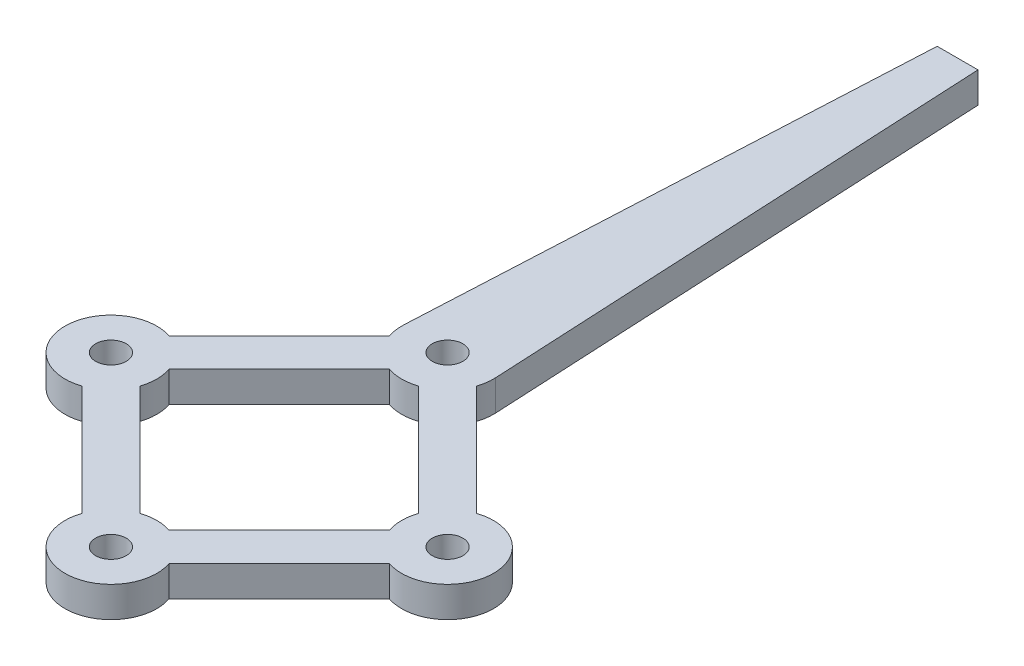
ISO-10303-21;
HEADER;
FILE_DESCRIPTION(('STEP AP214'),'2;1');
FILE_NAME('part.step','',(''),(''),'','','');
FILE_SCHEMA(('AUTOMOTIVE_DESIGN { 1 0 10303 214 1 1 1 1 }'));
ENDSEC;
DATA;
#1=APPLICATION_CONTEXT('core data for automotive mechanical design processes');
#2=APPLICATION_PROTOCOL_DEFINITION('international standard','automotive_design',2000,#1);
#3=PRODUCT_CONTEXT('',#1,'mechanical');
#4=PRODUCT('Part','Part','',(#3));
#5=PRODUCT_RELATED_PRODUCT_CATEGORY('part','',(#4));
#6=PRODUCT_DEFINITION_FORMATION('','',#4);
#7=PRODUCT_DEFINITION_CONTEXT('part definition',#1,'design');
#8=PRODUCT_DEFINITION('design','',#6,#7);
#9=PRODUCT_DEFINITION_SHAPE('','',#8);
#10=(LENGTH_UNIT() NAMED_UNIT(*) SI_UNIT(.MILLI.,.METRE.));
#11=(NAMED_UNIT(*) PLANE_ANGLE_UNIT() SI_UNIT($,.RADIAN.));
#12=(NAMED_UNIT(*) SI_UNIT($,.STERADIAN.) SOLID_ANGLE_UNIT());
#13=UNCERTAINTY_MEASURE_WITH_UNIT(LENGTH_MEASURE(1.E-05),#10,'distance_accuracy_value','');
#14=(GEOMETRIC_REPRESENTATION_CONTEXT(3) GLOBAL_UNCERTAINTY_ASSIGNED_CONTEXT((#13)) GLOBAL_UNIT_ASSIGNED_CONTEXT((#10,
#11,#12)) REPRESENTATION_CONTEXT('',''));
#15=CARTESIAN_POINT('',(0.,0.,0.));
#16=DIRECTION('',(0.,0.,1.));
#17=DIRECTION('',(1.,0.,0.));
#18=AXIS2_PLACEMENT_3D('',#15,#16,#17);
#19=CARTESIAN_POINT('',(0.,3.,-33.));
#20=DIRECTION('',(0.,1.,0.));
#21=DIRECTION('',(0.,0.,1.));
#22=AXIS2_PLACEMENT_3D('',#19,#20,#21);
#23=PLANE('',#22);
#24=CARTESIAN_POINT('',(16.5,3.,-16.5));
#25=DIRECTION('',(0.,1.,0.));
#26=DIRECTION('',(0.,0.,1.));
#27=AXIS2_PLACEMENT_3D('',#24,#25,#26);
#28=CIRCLE('',#27,1.5);
#29=CARTESIAN_POINT('',(16.5,3.,-15.));
#30=VERTEX_POINT('',#29);
#31=EDGE_CURVE('E236',#30,#30,#28,.T.);
#32=ORIENTED_EDGE('',*,*,#31,.F.);
#33=EDGE_LOOP('',(#32));
#34=FACE_BOUND('',#33,.T.);
#35=CARTESIAN_POINT('',(0.,3.,-33.));
#36=DIRECTION('',(0.,1.,0.));
#37=DIRECTION('',(0.,0.,1.));
#38=AXIS2_PLACEMENT_3D('',#35,#36,#37);
#39=CIRCLE('',#38,1.5);
#40=CARTESIAN_POINT('',(0.,3.,-31.5));
#41=VERTEX_POINT('',#40);
#42=EDGE_CURVE('E248',#41,#41,#39,.T.);
#43=ORIENTED_EDGE('',*,*,#42,.F.);
#44=EDGE_LOOP('',(#43));
#45=FACE_BOUND('',#44,.T.);
#46=CARTESIAN_POINT('',(0.,3.,-33.));
#47=DIRECTION('',(0.,1.,0.));
#48=DIRECTION('',(0.,0.,1.));
#49=AXIS2_PLACEMENT_3D('',#46,#47,#48);
#50=CIRCLE('',#49,4.5);
#51=CARTESIAN_POINT('',(-4.49639133210419,3.,-33.1801804333948));
#52=VERTEX_POINT('',#51);
#53=CARTESIAN_POINT('',(-4.26465212512094,3.,-31.5637749996253));
#54=VERTEX_POINT('',#53);
#55=EDGE_CURVE('E260',#52,#54,#50,.T.);
#56=ORIENTED_EDGE('',*,*,#55,.T.);
#57=DIRECTION('',(-0.707106781186548,0.,0.707106781186547));
#58=VECTOR('',#57,1.);
#59=CARTESIAN_POINT('',(-15.0637749996253,3.,-20.7646521251209));
#60=LINE('',#59,#58);
#61=CARTESIAN_POINT('',(-15.0637749996253,3.,-20.7646521251209));
#62=VERTEX_POINT('',#61);
#63=EDGE_CURVE('E263',#54,#62,#60,.T.);
#64=ORIENTED_EDGE('',*,*,#63,.T.);
#65=CARTESIAN_POINT('',(-16.5,3.,-16.5));
#66=DIRECTION('',(0.,1.,0.));
#67=DIRECTION('',(0.,0.,1.));
#68=AXIS2_PLACEMENT_3D('',#65,#66,#67);
#69=CIRCLE('',#68,4.5);
#70=CARTESIAN_POINT('',(-15.0637749996253,3.,-12.2353478748791));
#71=VERTEX_POINT('',#70);
#72=EDGE_CURVE('E266',#62,#71,#69,.T.);
#73=ORIENTED_EDGE('',*,*,#72,.T.);
#74=DIRECTION('',(0.707106781186548,0.,0.707106781186548));
#75=VECTOR('',#74,1.);
#76=CARTESIAN_POINT('',(-15.0637749996253,3.,-12.2353478748791));
#77=LINE('',#76,#75);
#78=CARTESIAN_POINT('',(-4.26465212512094,3.,-1.43622500037475));
#79=VERTEX_POINT('',#78);
#80=EDGE_CURVE('E268',#71,#79,#77,.T.);
#81=ORIENTED_EDGE('',*,*,#80,.T.);
#82=CARTESIAN_POINT('',(0.,3.,0.));
#83=DIRECTION('',(0.,1.,0.));
#84=DIRECTION('',(0.,0.,1.));
#85=AXIS2_PLACEMENT_3D('',#82,#83,#84);
#86=CIRCLE('',#85,4.5);
#87=CARTESIAN_POINT('',(4.26465212512094,3.,-1.43622500037475));
#88=VERTEX_POINT('',#87);
#89=EDGE_CURVE('E270',#79,#88,#86,.T.);
#90=ORIENTED_EDGE('',*,*,#89,.T.);
#91=DIRECTION('',(0.707106781186548,0.,-0.707106781186547));
#92=VECTOR('',#91,1.);
#93=CARTESIAN_POINT('',(4.26465212512094,3.,-1.43622500037475));
#94=LINE('',#93,#92);
#95=CARTESIAN_POINT('',(15.0637749996253,3.,-12.2353478748791));
#96=VERTEX_POINT('',#95);
#97=EDGE_CURVE('E272',#88,#96,#94,.T.);
#98=ORIENTED_EDGE('',*,*,#97,.T.);
#99=CARTESIAN_POINT('',(16.5,3.,-16.5));
#100=DIRECTION('',(0.,1.,0.));
#101=DIRECTION('',(0.,0.,1.));
#102=AXIS2_PLACEMENT_3D('',#99,#100,#101);
#103=CIRCLE('',#102,4.5);
#104=CARTESIAN_POINT('',(15.0637749996253,3.,-20.7646521251209));
#105=VERTEX_POINT('',#104);
#106=EDGE_CURVE('E274',#96,#105,#103,.T.);
#107=ORIENTED_EDGE('',*,*,#106,.T.);
#108=DIRECTION('',(-0.707106781186548,0.,-0.707106781186547));
#109=VECTOR('',#108,1.);
#110=CARTESIAN_POINT('',(15.0637749996253,3.,-20.7646521251209));
#111=LINE('',#110,#109);
#112=CARTESIAN_POINT('',(4.26465212512094,3.,-31.5637749996253));
#113=VERTEX_POINT('',#112);
#114=EDGE_CURVE('E276',#105,#113,#111,.T.);
#115=ORIENTED_EDGE('',*,*,#114,.T.);
#116=CARTESIAN_POINT('',(0.,3.,-33.));
#117=DIRECTION('',(0.,1.,0.));
#118=DIRECTION('',(0.,0.,1.));
#119=AXIS2_PLACEMENT_3D('',#116,#117,#118);
#120=CIRCLE('',#119,4.5);
#121=CARTESIAN_POINT('',(4.49436018053265,3.,-33.2252255927787));
#122=VERTEX_POINT('',#121);
#123=EDGE_CURVE('E278',#113,#122,#120,.T.);
#124=ORIENTED_EDGE('',*,*,#123,.T.);
#125=DIRECTION('',(-0.0500501317285987,0.,-0.998746706785034));
#126=VECTOR('',#125,1.);
#127=CARTESIAN_POINT('',(2.,3.,-83.));
#128=LINE('',#127,#126);
#129=CARTESIAN_POINT('',(2.,3.,-83.));
#130=VERTEX_POINT('',#129);
#131=EDGE_CURVE('E280',#122,#130,#128,.T.);
#132=ORIENTED_EDGE('',*,*,#131,.T.);
#133=DIRECTION('',(-1.,0.,0.));
#134=VECTOR('',#133,1.);
#135=CARTESIAN_POINT('',(-2.,3.,-83.));
#136=LINE('',#135,#134);
#137=CARTESIAN_POINT('',(-2.,3.,-83.));
#138=VERTEX_POINT('',#137);
#139=EDGE_CURVE('E282',#130,#138,#136,.T.);
#140=ORIENTED_EDGE('',*,*,#139,.T.);
#141=DIRECTION('',(-0.0500456085410825,0.,0.998746933444981));
#142=VECTOR('',#141,1.);
#143=CARTESIAN_POINT('',(-2.,3.,-83.));
#144=LINE('',#143,#142);
#145=EDGE_CURVE('E284',#138,#52,#144,.T.);
#146=ORIENTED_EDGE('',*,*,#145,.T.);
#147=EDGE_LOOP('',(#56,#64,#73,#81,#90,#98,#107,#115,#124,#132,#140,#146));
#148=FACE_BOUND('',#147,.T.);
#149=CARTESIAN_POINT('',(0.,3.,0.));
#150=DIRECTION('',(0.,1.,0.));
#151=DIRECTION('',(0.,0.,1.));
#152=AXIS2_PLACEMENT_3D('',#149,#150,#151);
#153=CIRCLE('',#152,1.5);
#154=CARTESIAN_POINT('',(0.,3.,1.5));
#155=VERTEX_POINT('',#154);
#156=EDGE_CURVE('E254',#155,#155,#153,.T.);
#157=ORIENTED_EDGE('',*,*,#156,.F.);
#158=EDGE_LOOP('',(#157));
#159=FACE_BOUND('',#158,.T.);
#160=CARTESIAN_POINT('',(-16.5,3.,-16.5));
#161=DIRECTION('',(0.,1.,0.));
#162=DIRECTION('',(0.,0.,-1.));
#163=AXIS2_PLACEMENT_3D('',#160,#161,#162);
#164=CIRCLE('',#163,1.5);
#165=CARTESIAN_POINT('',(-16.5,3.,-18.));
#166=VERTEX_POINT('',#165);
#167=EDGE_CURVE('E242',#166,#166,#164,.T.);
#168=ORIENTED_EDGE('',*,*,#167,.F.);
#169=EDGE_LOOP('',(#168));
#170=FACE_BOUND('',#169,.T.);
#171=DIRECTION('',(0.707106781186548,0.,-0.707106781186548));
#172=VECTOR('',#171,1.);
#173=CARTESIAN_POINT('',(1.43622500037475,3.,-4.26465212512094));
#174=LINE('',#173,#172);
#175=CARTESIAN_POINT('',(1.43622500037475,3.,-4.26465212512094));
#176=VERTEX_POINT('',#175);
#177=CARTESIAN_POINT('',(12.2353478748791,3.,-15.0637749996252));
#178=VERTEX_POINT('',#177);
#179=EDGE_CURVE('E179',#176,#178,#174,.T.);
#180=ORIENTED_EDGE('',*,*,#179,.F.);
#181=CARTESIAN_POINT('',(0.,3.,0.));
#182=DIRECTION('',(0.,-1.,0.));
#183=DIRECTION('',(0.,0.,1.));
#184=AXIS2_PLACEMENT_3D('',#181,#182,#183);
#185=CIRCLE('',#184,4.5);
#186=CARTESIAN_POINT('',(-1.43622500037475,3.,-4.26465212512094));
#187=VERTEX_POINT('',#186);
#188=EDGE_CURVE('E171',#187,#176,#185,.T.);
#189=ORIENTED_EDGE('',*,*,#188,.F.);
#190=DIRECTION('',(0.707106781186547,0.,0.707106781186548));
#191=VECTOR('',#190,1.);
#192=CARTESIAN_POINT('',(-12.2353478748791,3.,-15.0637749996253));
#193=LINE('',#192,#191);
#194=CARTESIAN_POINT('',(-12.2353478748791,3.,-15.0637749996252));
#195=VERTEX_POINT('',#194);
#196=EDGE_CURVE('E204',#195,#187,#193,.T.);
#197=ORIENTED_EDGE('',*,*,#196,.F.);
#198=CARTESIAN_POINT('',(-16.5,3.,-16.5));
#199=DIRECTION('',(0.,-1.,0.));
#200=DIRECTION('',(0.,0.,1.));
#201=AXIS2_PLACEMENT_3D('',#198,#199,#200);
#202=CIRCLE('',#201,4.5);
#203=CARTESIAN_POINT('',(-12.2353478748791,3.,-17.9362250003748));
#204=VERTEX_POINT('',#203);
#205=EDGE_CURVE('E202',#204,#195,#202,.T.);
#206=ORIENTED_EDGE('',*,*,#205,.F.);
#207=DIRECTION('',(-0.707106781186548,0.,0.707106781186547));
#208=VECTOR('',#207,1.);
#209=CARTESIAN_POINT('',(-12.2353478748791,3.,-17.9362250003748));
#210=LINE('',#209,#208);
#211=CARTESIAN_POINT('',(-1.43622500037475,3.,-28.7353478748791));
#212=VERTEX_POINT('',#211);
#213=EDGE_CURVE('E200',#212,#204,#210,.T.);
#214=ORIENTED_EDGE('',*,*,#213,.F.);
#215=CARTESIAN_POINT('',(0.,3.,-33.));
#216=DIRECTION('',(0.,-1.,0.));
#217=DIRECTION('',(0.,0.,1.));
#218=AXIS2_PLACEMENT_3D('',#215,#216,#217);
#219=CIRCLE('',#218,4.5);
#220=CARTESIAN_POINT('',(1.43622500037475,3.,-28.7353478748791));
#221=VERTEX_POINT('',#220);
#222=EDGE_CURVE('E198',#221,#212,#219,.T.);
#223=ORIENTED_EDGE('',*,*,#222,.F.);
#224=DIRECTION('',(-0.707106781186548,0.,-0.707106781186547));
#225=VECTOR('',#224,1.);
#226=CARTESIAN_POINT('',(12.2353478748791,3.,-17.9362250003748));
#227=LINE('',#226,#225);
#228=CARTESIAN_POINT('',(12.2353478748791,3.,-17.9362250003748));
#229=VERTEX_POINT('',#228);
#230=EDGE_CURVE('E194',#229,#221,#227,.T.);
#231=ORIENTED_EDGE('',*,*,#230,.F.);
#232=CARTESIAN_POINT('',(16.5,3.,-16.5));
#233=DIRECTION('',(0.,-1.,0.));
#234=DIRECTION('',(0.,0.,1.));
#235=AXIS2_PLACEMENT_3D('',#232,#233,#234);
#236=CIRCLE('',#235,4.5);
#237=EDGE_CURVE('E192',#178,#229,#236,.T.);
#238=ORIENTED_EDGE('',*,*,#237,.F.);
#239=EDGE_LOOP('',(#180,#189,#197,#206,#214,#223,#231,#238));
#240=FACE_BOUND('',#239,.T.);
#241=ADVANCED_FACE('F34',(#34,#45,#148,#159,#170,#240),#23,.T.);
#242=CARTESIAN_POINT('',(0.,0.,-33.));
#243=DIRECTION('',(0.,1.,0.));
#244=DIRECTION('',(0.,0.,1.));
#245=AXIS2_PLACEMENT_3D('',#242,#243,#244);
#246=PLANE('',#245);
#247=CARTESIAN_POINT('',(16.5,0.,-16.5));
#248=DIRECTION('',(0.,1.,0.));
#249=DIRECTION('',(0.,0.,1.));
#250=AXIS2_PLACEMENT_3D('',#247,#248,#249);
#251=CIRCLE('',#250,1.5);
#252=CARTESIAN_POINT('',(16.5,0.,-15.));
#253=VERTEX_POINT('',#252);
#254=EDGE_CURVE('E187',#253,#253,#251,.T.);
#255=ORIENTED_EDGE('',*,*,#254,.T.);
#256=EDGE_LOOP('',(#255));
#257=FACE_BOUND('',#256,.T.);
#258=CARTESIAN_POINT('',(0.,0.,-33.));
#259=DIRECTION('',(0.,1.,0.));
#260=DIRECTION('',(0.,0.,1.));
#261=AXIS2_PLACEMENT_3D('',#258,#259,#260);
#262=CIRCLE('',#261,1.5);
#263=CARTESIAN_POINT('',(0.,0.,-31.5));
#264=VERTEX_POINT('',#263);
#265=EDGE_CURVE('E245',#264,#264,#262,.T.);
#266=ORIENTED_EDGE('',*,*,#265,.T.);
#267=EDGE_LOOP('',(#266));
#268=FACE_BOUND('',#267,.T.);
#269=CARTESIAN_POINT('',(0.,0.,-33.));
#270=DIRECTION('',(0.,1.,0.));
#271=DIRECTION('',(0.,0.,1.));
#272=AXIS2_PLACEMENT_3D('',#269,#270,#271);
#273=CIRCLE('',#272,4.5);
#274=CARTESIAN_POINT('',(-4.49639133210419,0.,-33.1801804333948));
#275=VERTEX_POINT('',#274);
#276=CARTESIAN_POINT('',(-4.26465212512094,0.,-31.5637749996253));
#277=VERTEX_POINT('',#276);
#278=EDGE_CURVE('E257',#275,#277,#273,.T.);
#279=ORIENTED_EDGE('',*,*,#278,.F.);
#280=DIRECTION('',(-0.0500456085410825,0.,0.998746933444981));
#281=VECTOR('',#280,1.);
#282=CARTESIAN_POINT('',(-2.,0.,-83.));
#283=LINE('',#282,#281);
#284=CARTESIAN_POINT('',(-2.,0.,-83.));
#285=VERTEX_POINT('',#284);
#286=EDGE_CURVE('E264',#285,#275,#283,.T.);
#287=ORIENTED_EDGE('',*,*,#286,.F.);
#288=DIRECTION('',(-1.,0.,0.));
#289=VECTOR('',#288,1.);
#290=CARTESIAN_POINT('',(-2.,0.,-83.));
#291=LINE('',#290,#289);
#292=CARTESIAN_POINT('',(2.,0.,-83.));
#293=VERTEX_POINT('',#292);
#294=EDGE_CURVE('E307',#293,#285,#291,.T.);
#295=ORIENTED_EDGE('',*,*,#294,.F.);
#296=DIRECTION('',(-0.0500501317285987,0.,-0.998746706785034));
#297=VECTOR('',#296,1.);
#298=CARTESIAN_POINT('',(2.,0.,-83.));
#299=LINE('',#298,#297);
#300=CARTESIAN_POINT('',(4.49436018053265,0.,-33.2252255927787));
#301=VERTEX_POINT('',#300);
#302=EDGE_CURVE('E305',#301,#293,#299,.T.);
#303=ORIENTED_EDGE('',*,*,#302,.F.);
#304=CARTESIAN_POINT('',(0.,0.,-33.));
#305=DIRECTION('',(0.,1.,0.));
#306=DIRECTION('',(0.,0.,1.));
#307=AXIS2_PLACEMENT_3D('',#304,#305,#306);
#308=CIRCLE('',#307,4.5);
#309=CARTESIAN_POINT('',(4.26465212512094,0.,-31.5637749996253));
#310=VERTEX_POINT('',#309);
#311=EDGE_CURVE('E303',#310,#301,#308,.T.);
#312=ORIENTED_EDGE('',*,*,#311,.F.);
#313=DIRECTION('',(-0.707106781186548,0.,-0.707106781186547));
#314=VECTOR('',#313,1.);
#315=CARTESIAN_POINT('',(15.0637749996253,0.,-20.7646521251209));
#316=LINE('',#315,#314);
#317=CARTESIAN_POINT('',(15.0637749996253,0.,-20.7646521251209));
#318=VERTEX_POINT('',#317);
#319=EDGE_CURVE('E301',#318,#310,#316,.T.);
#320=ORIENTED_EDGE('',*,*,#319,.F.);
#321=CARTESIAN_POINT('',(16.5,0.,-16.5));
#322=DIRECTION('',(0.,1.,0.));
#323=DIRECTION('',(0.,0.,1.));
#324=AXIS2_PLACEMENT_3D('',#321,#322,#323);
#325=CIRCLE('',#324,4.5);
#326=CARTESIAN_POINT('',(15.0637749996253,0.,-12.2353478748791));
#327=VERTEX_POINT('',#326);
#328=EDGE_CURVE('E299',#327,#318,#325,.T.);
#329=ORIENTED_EDGE('',*,*,#328,.F.);
#330=DIRECTION('',(0.707106781186548,0.,-0.707106781186547));
#331=VECTOR('',#330,1.);
#332=CARTESIAN_POINT('',(4.26465212512094,0.,-1.43622500037475));
#333=LINE('',#332,#331);
#334=CARTESIAN_POINT('',(4.26465212512094,0.,-1.43622500037475));
#335=VERTEX_POINT('',#334);
#336=EDGE_CURVE('E297',#335,#327,#333,.T.);
#337=ORIENTED_EDGE('',*,*,#336,.F.);
#338=CARTESIAN_POINT('',(0.,0.,0.));
#339=DIRECTION('',(0.,1.,0.));
#340=DIRECTION('',(0.,0.,1.));
#341=AXIS2_PLACEMENT_3D('',#338,#339,#340);
#342=CIRCLE('',#341,4.5);
#343=CARTESIAN_POINT('',(-4.26465212512094,0.,-1.43622500037475));
#344=VERTEX_POINT('',#343);
#345=EDGE_CURVE('E295',#344,#335,#342,.T.);
#346=ORIENTED_EDGE('',*,*,#345,.F.);
#347=DIRECTION('',(0.707106781186548,0.,0.707106781186548));
#348=VECTOR('',#347,1.);
#349=CARTESIAN_POINT('',(-15.0637749996253,0.,-12.2353478748791));
#350=LINE('',#349,#348);
#351=CARTESIAN_POINT('',(-15.0637749996253,0.,-12.2353478748791));
#352=VERTEX_POINT('',#351);
#353=EDGE_CURVE('E293',#352,#344,#350,.T.);
#354=ORIENTED_EDGE('',*,*,#353,.F.);
#355=CARTESIAN_POINT('',(-16.5,0.,-16.5));
#356=DIRECTION('',(0.,1.,0.));
#357=DIRECTION('',(0.,0.,1.));
#358=AXIS2_PLACEMENT_3D('',#355,#356,#357);
#359=CIRCLE('',#358,4.5);
#360=CARTESIAN_POINT('',(-15.0637749996253,0.,-20.7646521251209));
#361=VERTEX_POINT('',#360);
#362=EDGE_CURVE('E291',#361,#352,#359,.T.);
#363=ORIENTED_EDGE('',*,*,#362,.F.);
#364=DIRECTION('',(-0.707106781186548,0.,0.707106781186547));
#365=VECTOR('',#364,1.);
#366=CARTESIAN_POINT('',(-15.0637749996253,0.,-20.7646521251209));
#367=LINE('',#366,#365);
#368=EDGE_CURVE('E289',#277,#361,#367,.T.);
#369=ORIENTED_EDGE('',*,*,#368,.F.);
#370=EDGE_LOOP('',(#279,#287,#295,#303,#312,#320,#329,#337,#346,#354,#363,#369));
#371=FACE_BOUND('',#370,.T.);
#372=CARTESIAN_POINT('',(0.,0.,0.));
#373=DIRECTION('',(0.,1.,0.));
#374=DIRECTION('',(0.,0.,1.));
#375=AXIS2_PLACEMENT_3D('',#372,#373,#374);
#376=CIRCLE('',#375,1.5);
#377=CARTESIAN_POINT('',(0.,0.,1.5));
#378=VERTEX_POINT('',#377);
#379=EDGE_CURVE('E251',#378,#378,#376,.T.);
#380=ORIENTED_EDGE('',*,*,#379,.T.);
#381=EDGE_LOOP('',(#380));
#382=FACE_BOUND('',#381,.T.);
#383=CARTESIAN_POINT('',(-16.5,0.,-16.5));
#384=DIRECTION('',(0.,1.,0.));
#385=DIRECTION('',(0.,0.,-1.));
#386=AXIS2_PLACEMENT_3D('',#383,#384,#385);
#387=CIRCLE('',#386,1.5);
#388=CARTESIAN_POINT('',(-16.5,0.,-18.));
#389=VERTEX_POINT('',#388);
#390=EDGE_CURVE('E239',#389,#389,#387,.T.);
#391=ORIENTED_EDGE('',*,*,#390,.T.);
#392=EDGE_LOOP('',(#391));
#393=FACE_BOUND('',#392,.T.);
#394=CARTESIAN_POINT('',(0.,0.,0.));
#395=DIRECTION('',(0.,-1.,0.));
#396=DIRECTION('',(0.,0.,1.));
#397=AXIS2_PLACEMENT_3D('',#394,#395,#396);
#398=CIRCLE('',#397,4.5);
#399=CARTESIAN_POINT('',(-1.43622500037475,0.,-4.26465212512094));
#400=VERTEX_POINT('',#399);
#401=CARTESIAN_POINT('',(1.43622500037475,0.,-4.26465212512094));
#402=VERTEX_POINT('',#401);
#403=EDGE_CURVE('E57',#400,#402,#398,.T.);
#404=ORIENTED_EDGE('',*,*,#403,.T.);
#405=DIRECTION('',(0.707106781186548,0.,-0.707106781186548));
#406=VECTOR('',#405,1.);
#407=CARTESIAN_POINT('',(1.43622500037475,0.,-4.26465212512094));
#408=LINE('',#407,#406);
#409=CARTESIAN_POINT('',(12.2353478748791,0.,-15.0637749996252));
#410=VERTEX_POINT('',#409);
#411=EDGE_CURVE('E186',#402,#410,#408,.T.);
#412=ORIENTED_EDGE('',*,*,#411,.T.);
#413=CARTESIAN_POINT('',(16.5,0.,-16.5));
#414=DIRECTION('',(0.,-1.,0.));
#415=DIRECTION('',(0.,0.,1.));
#416=AXIS2_PLACEMENT_3D('',#413,#414,#415);
#417=CIRCLE('',#416,4.5);
#418=CARTESIAN_POINT('',(12.2353478748791,0.,-17.9362250003748));
#419=VERTEX_POINT('',#418);
#420=EDGE_CURVE('E208',#410,#419,#417,.T.);
#421=ORIENTED_EDGE('',*,*,#420,.T.);
#422=DIRECTION('',(-0.707106781186548,0.,-0.707106781186547));
#423=VECTOR('',#422,1.);
#424=CARTESIAN_POINT('',(12.2353478748791,0.,-17.9362250003748));
#425=LINE('',#424,#423);
#426=CARTESIAN_POINT('',(1.43622500037475,0.,-28.7353478748791));
#427=VERTEX_POINT('',#426);
#428=EDGE_CURVE('E211',#419,#427,#425,.T.);
#429=ORIENTED_EDGE('',*,*,#428,.T.);
#430=CARTESIAN_POINT('',(0.,0.,-33.));
#431=DIRECTION('',(0.,-1.,0.));
#432=DIRECTION('',(0.,0.,1.));
#433=AXIS2_PLACEMENT_3D('',#430,#431,#432);
#434=CIRCLE('',#433,4.5);
#435=CARTESIAN_POINT('',(-1.43622500037475,0.,-28.7353478748791));
#436=VERTEX_POINT('',#435);
#437=EDGE_CURVE('E214',#427,#436,#434,.T.);
#438=ORIENTED_EDGE('',*,*,#437,.T.);
#439=DIRECTION('',(-0.707106781186548,0.,0.707106781186547));
#440=VECTOR('',#439,1.);
#441=CARTESIAN_POINT('',(-12.2353478748791,0.,-17.9362250003748));
#442=LINE('',#441,#440);
#443=CARTESIAN_POINT('',(-12.2353478748791,0.,-17.9362250003748));
#444=VERTEX_POINT('',#443);
#445=EDGE_CURVE('E217',#436,#444,#442,.T.);
#446=ORIENTED_EDGE('',*,*,#445,.T.);
#447=CARTESIAN_POINT('',(-16.5,0.,-16.5));
#448=DIRECTION('',(0.,-1.,0.));
#449=DIRECTION('',(0.,0.,1.));
#450=AXIS2_PLACEMENT_3D('',#447,#448,#449);
#451=CIRCLE('',#450,4.5);
#452=CARTESIAN_POINT('',(-12.2353478748791,0.,-15.0637749996253));
#453=VERTEX_POINT('',#452);
#454=EDGE_CURVE('E220',#444,#453,#451,.T.);
#455=ORIENTED_EDGE('',*,*,#454,.T.);
#456=DIRECTION('',(0.707106781186547,0.,0.707106781186548));
#457=VECTOR('',#456,1.);
#458=CARTESIAN_POINT('',(-12.2353478748791,0.,-15.0637749996253));
#459=LINE('',#458,#457);
#460=EDGE_CURVE('E180',#453,#400,#459,.T.);
#461=ORIENTED_EDGE('',*,*,#460,.T.);
#462=EDGE_LOOP('',(#404,#412,#421,#429,#438,#446,#455,#461));
#463=FACE_BOUND('',#462,.T.);
#464=ADVANCED_FACE('F349',(#257,#268,#371,#382,#393,#463),#246,.F.);
#465=CARTESIAN_POINT('',(0.,3.,-33.));
#466=DIRECTION('',(0.,-1.,0.));
#467=DIRECTION('',(0.,0.,-1.));
#468=AXIS2_PLACEMENT_3D('',#465,#466,#467);
#469=CYLINDRICAL_SURFACE('',#468,4.5);
#470=ORIENTED_EDGE('',*,*,#278,.T.);
#471=DIRECTION('',(0.,-1.,0.));
#472=VECTOR('',#471,1.);
#473=CARTESIAN_POINT('',(-4.26465212512094,3.,-31.5637749996253));
#474=LINE('',#473,#472);
#475=EDGE_CURVE('E11',#54,#277,#474,.T.);
#476=ORIENTED_EDGE('',*,*,#475,.F.);
#477=ORIENTED_EDGE('',*,*,#55,.F.);
#478=DIRECTION('',(0.,-1.,0.));
#479=VECTOR('',#478,1.);
#480=CARTESIAN_POINT('',(-4.49639133210419,3.,-33.1801804333948));
#481=LINE('',#480,#479);
#482=EDGE_CURVE('E286',#52,#275,#481,.T.);
#483=ORIENTED_EDGE('',*,*,#482,.T.);
#484=EDGE_LOOP('',(#470,#476,#477,#483));
#485=FACE_BOUND('',#484,.T.);
#486=ADVANCED_FACE('F36',(#485),#469,.T.);
#487=CARTESIAN_POINT('',(-15.0637749996253,3.,-20.7646521251209));
#488=DIRECTION('',(0.707106781186547,0.,0.707106781186548));
#489=DIRECTION('',(0.707106781186548,0.,-0.707106781186547));
#490=AXIS2_PLACEMENT_3D('',#487,#488,#489);
#491=PLANE('',#490);
#492=ORIENTED_EDGE('',*,*,#368,.T.);
#493=DIRECTION('',(0.,-1.,0.));
#494=VECTOR('',#493,1.);
#495=CARTESIAN_POINT('',(-15.0637749996253,3.,-20.7646521251209));
#496=LINE('',#495,#494);
#497=EDGE_CURVE('E42',#62,#361,#496,.T.);
#498=ORIENTED_EDGE('',*,*,#497,.F.);
#499=ORIENTED_EDGE('',*,*,#63,.F.);
#500=ORIENTED_EDGE('',*,*,#475,.T.);
#501=EDGE_LOOP('',(#492,#498,#499,#500));
#502=FACE_BOUND('',#501,.T.);
#503=ADVANCED_FACE('F367',(#502),#491,.F.);
#504=CARTESIAN_POINT('',(-16.5,3.,-16.5));
#505=DIRECTION('',(0.,-1.,0.));
#506=DIRECTION('',(0.,0.,-1.));
#507=AXIS2_PLACEMENT_3D('',#504,#505,#506);
#508=CYLINDRICAL_SURFACE('',#507,4.5);
#509=ORIENTED_EDGE('',*,*,#362,.T.);
#510=DIRECTION('',(0.,-1.,0.));
#511=VECTOR('',#510,1.);
#512=CARTESIAN_POINT('',(-15.0637749996253,3.,-12.2353478748791));
#513=LINE('',#512,#511);
#514=EDGE_CURVE('E336',#71,#352,#513,.T.);
#515=ORIENTED_EDGE('',*,*,#514,.F.);
#516=ORIENTED_EDGE('',*,*,#72,.F.);
#517=ORIENTED_EDGE('',*,*,#497,.T.);
#518=EDGE_LOOP('',(#509,#515,#516,#517));
#519=FACE_BOUND('',#518,.T.);
#520=ADVANCED_FACE('F343',(#519),#508,.T.);
#521=CARTESIAN_POINT('',(-15.0637749996253,3.,-12.2353478748791));
#522=DIRECTION('',(0.707106781186547,0.,-0.707106781186547));
#523=DIRECTION('',(-0.707106781186548,0.,-0.707106781186548));
#524=AXIS2_PLACEMENT_3D('',#521,#522,#523);
#525=PLANE('',#524);
#526=ORIENTED_EDGE('',*,*,#353,.T.);
#527=DIRECTION('',(0.,-1.,0.));
#528=VECTOR('',#527,1.);
#529=CARTESIAN_POINT('',(-4.26465212512094,3.,-1.43622500037475));
#530=LINE('',#529,#528);
#531=EDGE_CURVE('E333',#79,#344,#530,.T.);
#532=ORIENTED_EDGE('',*,*,#531,.F.);
#533=ORIENTED_EDGE('',*,*,#80,.F.);
#534=ORIENTED_EDGE('',*,*,#514,.T.);
#535=EDGE_LOOP('',(#526,#532,#533,#534));
#536=FACE_BOUND('',#535,.T.);
#537=ADVANCED_FACE('F355',(#536),#525,.F.);
#538=CARTESIAN_POINT('',(0.,3.,0.));
#539=DIRECTION('',(0.,-1.,0.));
#540=DIRECTION('',(0.,0.,-1.));
#541=AXIS2_PLACEMENT_3D('',#538,#539,#540);
#542=CYLINDRICAL_SURFACE('',#541,4.5);
#543=ORIENTED_EDGE('',*,*,#345,.T.);
#544=DIRECTION('',(0.,-1.,0.));
#545=VECTOR('',#544,1.);
#546=CARTESIAN_POINT('',(4.26465212512094,3.,-1.43622500037475));
#547=LINE('',#546,#545);
#548=EDGE_CURVE('E330',#88,#335,#547,.T.);
#549=ORIENTED_EDGE('',*,*,#548,.F.);
#550=ORIENTED_EDGE('',*,*,#89,.F.);
#551=ORIENTED_EDGE('',*,*,#531,.T.);
#552=EDGE_LOOP('',(#543,#549,#550,#551));
#553=FACE_BOUND('',#552,.T.);
#554=ADVANCED_FACE('F359',(#553),#542,.T.);
#555=CARTESIAN_POINT('',(4.26465212512094,3.,-1.43622500037475));
#556=DIRECTION('',(-0.707106781186547,0.,-0.707106781186548));
#557=DIRECTION('',(-0.707106781186548,0.,0.707106781186547));
#558=AXIS2_PLACEMENT_3D('',#555,#556,#557);
#559=PLANE('',#558);
#560=ORIENTED_EDGE('',*,*,#336,.T.);
#561=DIRECTION('',(0.,-1.,0.));
#562=VECTOR('',#561,1.);
#563=CARTESIAN_POINT('',(15.0637749996253,3.,-12.2353478748791));
#564=LINE('',#563,#562);
#565=EDGE_CURVE('E327',#96,#327,#564,.T.);
#566=ORIENTED_EDGE('',*,*,#565,.F.);
#567=ORIENTED_EDGE('',*,*,#97,.F.);
#568=ORIENTED_EDGE('',*,*,#548,.T.);
#569=EDGE_LOOP('',(#560,#566,#567,#568));
#570=FACE_BOUND('',#569,.T.);
#571=ADVANCED_FACE('F400',(#570),#559,.F.);
#572=CARTESIAN_POINT('',(16.5,3.,-16.5));
#573=DIRECTION('',(0.,-1.,0.));
#574=DIRECTION('',(0.,0.,-1.));
#575=AXIS2_PLACEMENT_3D('',#572,#573,#574);
#576=CYLINDRICAL_SURFACE('',#575,4.5);
#577=ORIENTED_EDGE('',*,*,#328,.T.);
#578=DIRECTION('',(0.,-1.,0.));
#579=VECTOR('',#578,1.);
#580=CARTESIAN_POINT('',(15.0637749996253,3.,-20.7646521251209));
#581=LINE('',#580,#579);
#582=EDGE_CURVE('E324',#105,#318,#581,.T.);
#583=ORIENTED_EDGE('',*,*,#582,.F.);
#584=ORIENTED_EDGE('',*,*,#106,.F.);
#585=ORIENTED_EDGE('',*,*,#565,.T.);
#586=EDGE_LOOP('',(#577,#583,#584,#585));
#587=FACE_BOUND('',#586,.T.);
#588=ADVANCED_FACE('F398',(#587),#576,.T.);
#589=CARTESIAN_POINT('',(15.0637749996253,3.,-20.7646521251209));
#590=DIRECTION('',(-0.707106781186547,0.,0.707106781186548));
#591=DIRECTION('',(0.707106781186548,0.,0.707106781186547));
#592=AXIS2_PLACEMENT_3D('',#589,#590,#591);
#593=PLANE('',#592);
#594=ORIENTED_EDGE('',*,*,#319,.T.);
#595=DIRECTION('',(0.,-1.,0.));
#596=VECTOR('',#595,1.);
#597=CARTESIAN_POINT('',(4.26465212512094,3.,-31.5637749996253));
#598=LINE('',#597,#596);
#599=EDGE_CURVE('E321',#113,#310,#598,.T.);
#600=ORIENTED_EDGE('',*,*,#599,.F.);
#601=ORIENTED_EDGE('',*,*,#114,.F.);
#602=ORIENTED_EDGE('',*,*,#582,.T.);
#603=EDGE_LOOP('',(#594,#600,#601,#602));
#604=FACE_BOUND('',#603,.T.);
#605=ADVANCED_FACE('F394',(#604),#593,.F.);
#606=CARTESIAN_POINT('',(0.,3.,-33.));
#607=DIRECTION('',(0.,-1.,0.));
#608=DIRECTION('',(0.,0.,-1.));
#609=AXIS2_PLACEMENT_3D('',#606,#607,#608);
#610=CYLINDRICAL_SURFACE('',#609,4.5);
#611=ORIENTED_EDGE('',*,*,#311,.T.);
#612=DIRECTION('',(0.,-1.,0.));
#613=VECTOR('',#612,1.);
#614=CARTESIAN_POINT('',(4.49436018053265,3.,-33.2252255927787));
#615=LINE('',#614,#613);
#616=EDGE_CURVE('E318',#122,#301,#615,.T.);
#617=ORIENTED_EDGE('',*,*,#616,.F.);
#618=ORIENTED_EDGE('',*,*,#123,.F.);
#619=ORIENTED_EDGE('',*,*,#599,.T.);
#620=EDGE_LOOP('',(#611,#617,#618,#619));
#621=FACE_BOUND('',#620,.T.);
#622=ADVANCED_FACE('F389',(#621),#610,.T.);
#623=CARTESIAN_POINT('',(2.,3.,-83.));
#624=DIRECTION('',(-0.998746706785034,0.,0.0500501317285987));
#625=DIRECTION('',(0.0500501317285987,0.,0.998746706785034));
#626=AXIS2_PLACEMENT_3D('',#623,#624,#625);
#627=PLANE('',#626);
#628=ORIENTED_EDGE('',*,*,#302,.T.);
#629=DIRECTION('',(0.,-1.,0.));
#630=VECTOR('',#629,1.);
#631=CARTESIAN_POINT('',(2.,3.,-83.));
#632=LINE('',#631,#630);
#633=EDGE_CURVE('E315',#130,#293,#632,.T.);
#634=ORIENTED_EDGE('',*,*,#633,.F.);
#635=ORIENTED_EDGE('',*,*,#131,.F.);
#636=ORIENTED_EDGE('',*,*,#616,.T.);
#637=EDGE_LOOP('',(#628,#634,#635,#636));
#638=FACE_BOUND('',#637,.T.);
#639=ADVANCED_FACE('F383',(#638),#627,.F.);
#640=CARTESIAN_POINT('',(-2.,3.,-83.));
#641=DIRECTION('',(0.,0.,1.));
#642=DIRECTION('',(1.,0.,0.));
#643=AXIS2_PLACEMENT_3D('',#640,#641,#642);
#644=PLANE('',#643);
#645=ORIENTED_EDGE('',*,*,#294,.T.);
#646=DIRECTION('',(0.,-1.,0.));
#647=VECTOR('',#646,1.);
#648=CARTESIAN_POINT('',(-2.,3.,-83.));
#649=LINE('',#648,#647);
#650=EDGE_CURVE('E312',#138,#285,#649,.T.);
#651=ORIENTED_EDGE('',*,*,#650,.F.);
#652=ORIENTED_EDGE('',*,*,#139,.F.);
#653=ORIENTED_EDGE('',*,*,#633,.T.);
#654=EDGE_LOOP('',(#645,#651,#652,#653));
#655=FACE_BOUND('',#654,.T.);
#656=ADVANCED_FACE('F379',(#655),#644,.F.);
#657=CARTESIAN_POINT('',(-2.,3.,-83.));
#658=DIRECTION('',(0.998746933444981,0.,0.0500456085410825));
#659=DIRECTION('',(0.0500456085410825,0.,-0.998746933444981));
#660=AXIS2_PLACEMENT_3D('',#657,#658,#659);
#661=PLANE('',#660);
#662=ORIENTED_EDGE('',*,*,#286,.T.);
#663=ORIENTED_EDGE('',*,*,#482,.F.);
#664=ORIENTED_EDGE('',*,*,#145,.F.);
#665=ORIENTED_EDGE('',*,*,#650,.T.);
#666=EDGE_LOOP('',(#662,#663,#664,#665));
#667=FACE_BOUND('',#666,.T.);
#668=ADVANCED_FACE('F374',(#667),#661,.F.);
#669=CARTESIAN_POINT('',(0.,3.,0.));
#670=DIRECTION('',(0.,-1.,0.));
#671=DIRECTION('',(0.,0.,-1.));
#672=AXIS2_PLACEMENT_3D('',#669,#670,#671);
#673=CYLINDRICAL_SURFACE('',#672,1.5);
#674=ORIENTED_EDGE('',*,*,#156,.T.);
#675=EDGE_LOOP('',(#674));
#676=FACE_BOUND('',#675,.T.);
#677=ORIENTED_EDGE('',*,*,#379,.F.);
#678=EDGE_LOOP('',(#677));
#679=FACE_BOUND('',#678,.T.);
#680=ADVANCED_FACE('F420',(#676,#679),#673,.F.);
#681=CARTESIAN_POINT('',(0.,3.,-33.));
#682=DIRECTION('',(0.,-1.,0.));
#683=DIRECTION('',(0.,0.,-1.));
#684=AXIS2_PLACEMENT_3D('',#681,#682,#683);
#685=CYLINDRICAL_SURFACE('',#684,1.5);
#686=ORIENTED_EDGE('',*,*,#42,.T.);
#687=EDGE_LOOP('',(#686));
#688=FACE_BOUND('',#687,.T.);
#689=ORIENTED_EDGE('',*,*,#265,.F.);
#690=EDGE_LOOP('',(#689));
#691=FACE_BOUND('',#690,.T.);
#692=ADVANCED_FACE('F458',(#688,#691),#685,.F.);
#693=CARTESIAN_POINT('',(-16.5,3.,-16.5));
#694=DIRECTION('',(0.,-1.,0.));
#695=DIRECTION('',(0.,0.,-1.));
#696=AXIS2_PLACEMENT_3D('',#693,#694,#695);
#697=CYLINDRICAL_SURFACE('',#696,1.5);
#698=ORIENTED_EDGE('',*,*,#167,.T.);
#699=EDGE_LOOP('',(#698));
#700=FACE_BOUND('',#699,.T.);
#701=ORIENTED_EDGE('',*,*,#390,.F.);
#702=EDGE_LOOP('',(#701));
#703=FACE_BOUND('',#702,.T.);
#704=ADVANCED_FACE('F465',(#700,#703),#697,.F.);
#705=CARTESIAN_POINT('',(16.5,3.,-16.5));
#706=DIRECTION('',(0.,-1.,0.));
#707=DIRECTION('',(0.,0.,-1.));
#708=AXIS2_PLACEMENT_3D('',#705,#706,#707);
#709=CYLINDRICAL_SURFACE('',#708,1.5);
#710=ORIENTED_EDGE('',*,*,#31,.T.);
#711=EDGE_LOOP('',(#710));
#712=FACE_BOUND('',#711,.T.);
#713=ORIENTED_EDGE('',*,*,#254,.F.);
#714=EDGE_LOOP('',(#713));
#715=FACE_BOUND('',#714,.T.);
#716=ADVANCED_FACE('F472',(#712,#715),#709,.F.);
#717=CARTESIAN_POINT('',(0.,3.,0.));
#718=DIRECTION('',(0.,-1.,0.));
#719=DIRECTION('',(0.,0.,-1.));
#720=AXIS2_PLACEMENT_3D('',#717,#718,#719);
#721=CYLINDRICAL_SURFACE('',#720,4.5);
#722=ORIENTED_EDGE('',*,*,#403,.F.);
#723=DIRECTION('',(0.,-1.,0.));
#724=VECTOR('',#723,1.);
#725=CARTESIAN_POINT('',(-1.43622500037475,3.,-4.26465212512094));
#726=LINE('',#725,#724);
#727=EDGE_CURVE('E175',#187,#400,#726,.T.);
#728=ORIENTED_EDGE('',*,*,#727,.F.);
#729=ORIENTED_EDGE('',*,*,#188,.T.);
#730=DIRECTION('',(0.,-1.,0.));
#731=VECTOR('',#730,1.);
#732=CARTESIAN_POINT('',(1.43622500037475,3.,-4.26465212512094));
#733=LINE('',#732,#731);
#734=EDGE_CURVE('E174',#176,#402,#733,.T.);
#735=ORIENTED_EDGE('',*,*,#734,.T.);
#736=EDGE_LOOP('',(#722,#728,#729,#735));
#737=FACE_BOUND('',#736,.T.);
#738=ADVANCED_FACE('F173',(#737),#721,.T.);
#739=CARTESIAN_POINT('',(1.43622500037475,3.,-4.26465212512094));
#740=DIRECTION('',(-0.707106781186547,0.,-0.707106781186547));
#741=DIRECTION('',(-0.707106781186548,0.,0.707106781186548));
#742=AXIS2_PLACEMENT_3D('',#739,#740,#741);
#743=PLANE('',#742);
#744=ORIENTED_EDGE('',*,*,#411,.F.);
#745=ORIENTED_EDGE('',*,*,#734,.F.);
#746=ORIENTED_EDGE('',*,*,#179,.T.);
#747=DIRECTION('',(0.,-1.,0.));
#748=VECTOR('',#747,1.);
#749=CARTESIAN_POINT('',(12.2353478748791,3.,-15.0637749996252));
#750=LINE('',#749,#748);
#751=EDGE_CURVE('E188',#178,#410,#750,.T.);
#752=ORIENTED_EDGE('',*,*,#751,.T.);
#753=EDGE_LOOP('',(#744,#745,#746,#752));
#754=FACE_BOUND('',#753,.T.);
#755=ADVANCED_FACE('F183',(#754),#743,.T.);
#756=CARTESIAN_POINT('',(16.5,3.,-16.5));
#757=DIRECTION('',(0.,-1.,0.));
#758=DIRECTION('',(0.,0.,-1.));
#759=AXIS2_PLACEMENT_3D('',#756,#757,#758);
#760=CYLINDRICAL_SURFACE('',#759,4.5);
#761=ORIENTED_EDGE('',*,*,#420,.F.);
#762=ORIENTED_EDGE('',*,*,#751,.F.);
#763=ORIENTED_EDGE('',*,*,#237,.T.);
#764=DIRECTION('',(0.,-1.,0.));
#765=VECTOR('',#764,1.);
#766=CARTESIAN_POINT('',(12.2353478748791,3.,-17.9362250003748));
#767=LINE('',#766,#765);
#768=EDGE_CURVE('E233',#229,#419,#767,.T.);
#769=ORIENTED_EDGE('',*,*,#768,.T.);
#770=EDGE_LOOP('',(#761,#762,#763,#769));
#771=FACE_BOUND('',#770,.T.);
#772=ADVANCED_FACE('F493',(#771),#760,.T.);
#773=CARTESIAN_POINT('',(12.2353478748791,3.,-17.9362250003748));
#774=DIRECTION('',(-0.707106781186547,0.,0.707106781186548));
#775=DIRECTION('',(0.707106781186548,0.,0.707106781186547));
#776=AXIS2_PLACEMENT_3D('',#773,#774,#775);
#777=PLANE('',#776);
#778=ORIENTED_EDGE('',*,*,#428,.F.);
#779=ORIENTED_EDGE('',*,*,#768,.F.);
#780=ORIENTED_EDGE('',*,*,#230,.T.);
#781=DIRECTION('',(0.,-1.,0.));
#782=VECTOR('',#781,1.);
#783=CARTESIAN_POINT('',(1.43622500037475,3.,-28.7353478748791));
#784=LINE('',#783,#782);
#785=EDGE_CURVE('E231',#221,#427,#784,.T.);
#786=ORIENTED_EDGE('',*,*,#785,.T.);
#787=EDGE_LOOP('',(#778,#779,#780,#786));
#788=FACE_BOUND('',#787,.T.);
#789=ADVANCED_FACE('F500',(#788),#777,.T.);
#790=CARTESIAN_POINT('',(0.,3.,-33.));
#791=DIRECTION('',(0.,-1.,0.));
#792=DIRECTION('',(0.,0.,-1.));
#793=AXIS2_PLACEMENT_3D('',#790,#791,#792);
#794=CYLINDRICAL_SURFACE('',#793,4.5);
#795=ORIENTED_EDGE('',*,*,#437,.F.);
#796=ORIENTED_EDGE('',*,*,#785,.F.);
#797=ORIENTED_EDGE('',*,*,#222,.T.);
#798=DIRECTION('',(0.,-1.,0.));
#799=VECTOR('',#798,1.);
#800=CARTESIAN_POINT('',(-1.43622500037475,3.,-28.7353478748791));
#801=LINE('',#800,#799);
#802=EDGE_CURVE('E229',#212,#436,#801,.T.);
#803=ORIENTED_EDGE('',*,*,#802,.T.);
#804=EDGE_LOOP('',(#795,#796,#797,#803));
#805=FACE_BOUND('',#804,.T.);
#806=ADVANCED_FACE('F508',(#805),#794,.T.);
#807=CARTESIAN_POINT('',(-12.2353478748791,3.,-17.9362250003748));
#808=DIRECTION('',(0.707106781186547,0.,0.707106781186548));
#809=DIRECTION('',(0.707106781186548,0.,-0.707106781186547));
#810=AXIS2_PLACEMENT_3D('',#807,#808,#809);
#811=PLANE('',#810);
#812=ORIENTED_EDGE('',*,*,#445,.F.);
#813=ORIENTED_EDGE('',*,*,#802,.F.);
#814=ORIENTED_EDGE('',*,*,#213,.T.);
#815=DIRECTION('',(0.,-1.,0.));
#816=VECTOR('',#815,1.);
#817=CARTESIAN_POINT('',(-12.2353478748791,3.,-17.9362250003748));
#818=LINE('',#817,#816);
#819=EDGE_CURVE('E227',#204,#444,#818,.T.);
#820=ORIENTED_EDGE('',*,*,#819,.T.);
#821=EDGE_LOOP('',(#812,#813,#814,#820));
#822=FACE_BOUND('',#821,.T.);
#823=ADVANCED_FACE('F516',(#822),#811,.T.);
#824=CARTESIAN_POINT('',(-16.5,3.,-16.5));
#825=DIRECTION('',(0.,-1.,0.));
#826=DIRECTION('',(0.,0.,-1.));
#827=AXIS2_PLACEMENT_3D('',#824,#825,#826);
#828=CYLINDRICAL_SURFACE('',#827,4.5);
#829=ORIENTED_EDGE('',*,*,#454,.F.);
#830=ORIENTED_EDGE('',*,*,#819,.F.);
#831=ORIENTED_EDGE('',*,*,#205,.T.);
#832=DIRECTION('',(0.,-1.,0.));
#833=VECTOR('',#832,1.);
#834=CARTESIAN_POINT('',(-12.2353478748791,3.,-15.0637749996253));
#835=LINE('',#834,#833);
#836=EDGE_CURVE('E49',#195,#453,#835,.T.);
#837=ORIENTED_EDGE('',*,*,#836,.T.);
#838=EDGE_LOOP('',(#829,#830,#831,#837));
#839=FACE_BOUND('',#838,.T.);
#840=ADVANCED_FACE('F524',(#839),#828,.T.);
#841=CARTESIAN_POINT('',(-12.2353478748791,3.,-15.0637749996253));
#842=DIRECTION('',(0.707106781186548,0.,-0.707106781186547));
#843=DIRECTION('',(-0.707106781186547,0.,-0.707106781186548));
#844=AXIS2_PLACEMENT_3D('',#841,#842,#843);
#845=PLANE('',#844);
#846=ORIENTED_EDGE('',*,*,#460,.F.);
#847=ORIENTED_EDGE('',*,*,#836,.F.);
#848=ORIENTED_EDGE('',*,*,#196,.T.);
#849=ORIENTED_EDGE('',*,*,#727,.T.);
#850=EDGE_LOOP('',(#846,#847,#848,#849));
#851=FACE_BOUND('',#850,.T.);
#852=ADVANCED_FACE('F532',(#851),#845,.T.);
#853=CLOSED_SHELL('',(#241,#464,#486,#503,#520,#537,#554,#571,#588,#605,#622,#639,#656,#668,
#680,#692,#704,#716,#738,#755,#772,#789,#806,#823,#840,#852));
#854=MANIFOLD_SOLID_BREP('B2',#853);
#855=ADVANCED_BREP_SHAPE_REPRESENTATION('',(#18,#854),#14);
#856=SHAPE_DEFINITION_REPRESENTATION(#9,#855);
ENDSEC;
END-ISO-10303-21;
